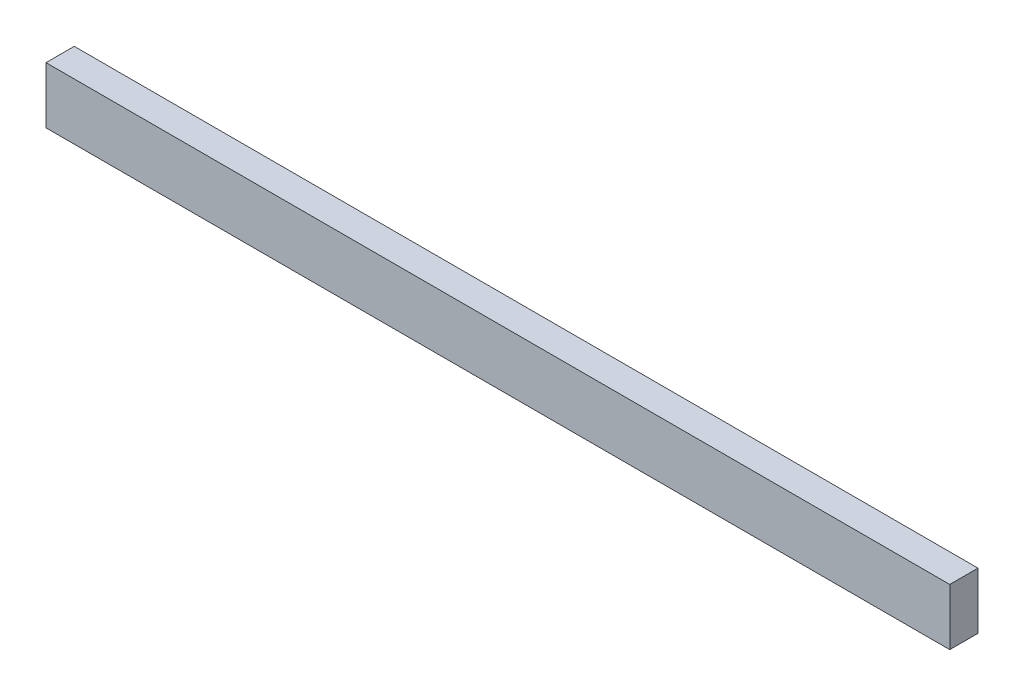
ISO-10303-21;
HEADER;
FILE_DESCRIPTION(('STEP AP214'),'2;1');
FILE_NAME('part.step','',(''),(''),'','','');
FILE_SCHEMA(('AUTOMOTIVE_DESIGN { 1 0 10303 214 1 1 1 1 }'));
ENDSEC;
DATA;
#1=APPLICATION_CONTEXT('core data for automotive mechanical design processes');
#2=APPLICATION_PROTOCOL_DEFINITION('international standard','automotive_design',2000,#1);
#3=PRODUCT_CONTEXT('',#1,'mechanical');
#4=PRODUCT('Part','Part','',(#3));
#5=PRODUCT_RELATED_PRODUCT_CATEGORY('part','',(#4));
#6=PRODUCT_DEFINITION_FORMATION('','',#4);
#7=PRODUCT_DEFINITION_CONTEXT('part definition',#1,'design');
#8=PRODUCT_DEFINITION('design','',#6,#7);
#9=PRODUCT_DEFINITION_SHAPE('','',#8);
#10=(LENGTH_UNIT() NAMED_UNIT(*) SI_UNIT(.MILLI.,.METRE.));
#11=(NAMED_UNIT(*) PLANE_ANGLE_UNIT() SI_UNIT($,.RADIAN.));
#12=(NAMED_UNIT(*) SI_UNIT($,.STERADIAN.) SOLID_ANGLE_UNIT());
#13=UNCERTAINTY_MEASURE_WITH_UNIT(LENGTH_MEASURE(1.E-05),#10,'distance_accuracy_value','');
#14=(GEOMETRIC_REPRESENTATION_CONTEXT(3) GLOBAL_UNCERTAINTY_ASSIGNED_CONTEXT((#13)) GLOBAL_UNIT_ASSIGNED_CONTEXT((#10,
#11,#12)) REPRESENTATION_CONTEXT('',''));
#15=CARTESIAN_POINT('',(0.,0.,0.));
#16=DIRECTION('',(0.,0.,1.));
#17=DIRECTION('',(1.,0.,0.));
#18=AXIS2_PLACEMENT_3D('',#15,#16,#17);
#19=CARTESIAN_POINT('',(58.5124494054143,8.30021736228653,3.175));
#20=DIRECTION('',(-1.,0.,0.));
#21=DIRECTION('',(0.,0.,1.));
#22=AXIS2_PLACEMENT_3D('',#19,#20,#21);
#23=PLANE('',#22);
#24=DIRECTION('',(0.,1.,0.));
#25=VECTOR('',#24,1.);
#26=CARTESIAN_POINT('',(58.5124494054143,8.30021736228653,0.));
#27=LINE('',#26,#25);
#28=CARTESIAN_POINT('',(58.5124494054143,8.30021736228653,0.));
#29=VERTEX_POINT('',#28);
#30=CARTESIAN_POINT('',(58.5124494054143,14.6502173622865,0.));
#31=VERTEX_POINT('',#30);
#32=EDGE_CURVE('E96',#29,#31,#27,.T.);
#33=ORIENTED_EDGE('',*,*,#32,.T.);
#34=DIRECTION('',(0.,0.,-1.));
#35=VECTOR('',#34,1.);
#36=CARTESIAN_POINT('',(58.5124494054143,14.6502173622865,3.175));
#37=LINE('',#36,#35);
#38=CARTESIAN_POINT('',(58.5124494054143,14.6502173622865,3.175));
#39=VERTEX_POINT('',#38);
#40=EDGE_CURVE('E11',#39,#31,#37,.T.);
#41=ORIENTED_EDGE('',*,*,#40,.F.);
#42=DIRECTION('',(0.,1.,0.));
#43=VECTOR('',#42,1.);
#44=CARTESIAN_POINT('',(58.5124494054143,8.30021736228653,3.175));
#45=LINE('',#44,#43);
#46=CARTESIAN_POINT('',(58.5124494054143,8.30021736228653,3.175));
#47=VERTEX_POINT('',#46);
#48=EDGE_CURVE('E84',#47,#39,#45,.T.);
#49=ORIENTED_EDGE('',*,*,#48,.F.);
#50=DIRECTION('',(0.,0.,-1.));
#51=VECTOR('',#50,1.);
#52=CARTESIAN_POINT('',(58.5124494054143,8.30021736228653,3.175));
#53=LINE('',#52,#51);
#54=EDGE_CURVE('E92',#47,#29,#53,.T.);
#55=ORIENTED_EDGE('',*,*,#54,.T.);
#56=EDGE_LOOP('',(#33,#41,#49,#55));
#57=FACE_BOUND('',#56,.T.);
#58=ADVANCED_FACE('F33',(#57),#23,.F.);
#59=CARTESIAN_POINT('',(-43.0875505945857,14.6502173622865,3.175));
#60=DIRECTION('',(0.,-1.,0.));
#61=DIRECTION('',(0.,0.,-1.));
#62=AXIS2_PLACEMENT_3D('',#59,#60,#61);
#63=PLANE('',#62);
#64=DIRECTION('',(-1.,0.,0.));
#65=VECTOR('',#64,1.);
#66=CARTESIAN_POINT('',(-43.0875505945857,14.6502173622865,0.));
#67=LINE('',#66,#65);
#68=CARTESIAN_POINT('',(-43.0875505945857,14.6502173622865,0.));
#69=VERTEX_POINT('',#68);
#70=EDGE_CURVE('E88',#31,#69,#67,.T.);
#71=ORIENTED_EDGE('',*,*,#70,.T.);
#72=DIRECTION('',(0.,0.,-1.));
#73=VECTOR('',#72,1.);
#74=CARTESIAN_POINT('',(-43.0875505945857,14.6502173622865,3.175));
#75=LINE('',#74,#73);
#76=CARTESIAN_POINT('',(-43.0875505945857,14.6502173622865,3.175));
#77=VERTEX_POINT('',#76);
#78=EDGE_CURVE('E41',#77,#69,#75,.T.);
#79=ORIENTED_EDGE('',*,*,#78,.F.);
#80=DIRECTION('',(-1.,0.,0.));
#81=VECTOR('',#80,1.);
#82=CARTESIAN_POINT('',(-43.0875505945857,14.6502173622865,3.175));
#83=LINE('',#82,#81);
#84=EDGE_CURVE('E79',#39,#77,#83,.T.);
#85=ORIENTED_EDGE('',*,*,#84,.F.);
#86=ORIENTED_EDGE('',*,*,#40,.T.);
#87=EDGE_LOOP('',(#71,#79,#85,#86));
#88=FACE_BOUND('',#87,.T.);
#89=ADVANCED_FACE('F87',(#88),#63,.F.);
#90=CARTESIAN_POINT('',(-43.0875505945857,8.30021736228653,3.175));
#91=DIRECTION('',(1.,0.,0.));
#92=DIRECTION('',(0.,0.,-1.));
#93=AXIS2_PLACEMENT_3D('',#90,#91,#92);
#94=PLANE('',#93);
#95=DIRECTION('',(0.,-1.,0.));
#96=VECTOR('',#95,1.);
#97=CARTESIAN_POINT('',(-43.0875505945857,8.30021736228653,0.));
#98=LINE('',#97,#96);
#99=CARTESIAN_POINT('',(-43.0875505945857,8.30021736228653,0.));
#100=VERTEX_POINT('',#99);
#101=EDGE_CURVE('E66',#69,#100,#98,.T.);
#102=ORIENTED_EDGE('',*,*,#101,.T.);
#103=DIRECTION('',(0.,0.,-1.));
#104=VECTOR('',#103,1.);
#105=CARTESIAN_POINT('',(-43.0875505945857,8.30021736228653,3.175));
#106=LINE('',#105,#104);
#107=CARTESIAN_POINT('',(-43.0875505945857,8.30021736228653,3.175));
#108=VERTEX_POINT('',#107);
#109=EDGE_CURVE('E89',#108,#100,#106,.T.);
#110=ORIENTED_EDGE('',*,*,#109,.F.);
#111=DIRECTION('',(0.,-1.,0.));
#112=VECTOR('',#111,1.);
#113=CARTESIAN_POINT('',(-43.0875505945857,8.30021736228653,3.175));
#114=LINE('',#113,#112);
#115=EDGE_CURVE('E82',#77,#108,#114,.T.);
#116=ORIENTED_EDGE('',*,*,#115,.F.);
#117=ORIENTED_EDGE('',*,*,#78,.T.);
#118=EDGE_LOOP('',(#102,#110,#116,#117));
#119=FACE_BOUND('',#118,.T.);
#120=ADVANCED_FACE('F90',(#119),#94,.F.);
#121=CARTESIAN_POINT('',(-43.0875505945857,8.30021736228653,3.175));
#122=DIRECTION('',(0.,1.,0.));
#123=DIRECTION('',(0.,0.,1.));
#124=AXIS2_PLACEMENT_3D('',#121,#122,#123);
#125=PLANE('',#124);
#126=DIRECTION('',(1.,0.,0.));
#127=VECTOR('',#126,1.);
#128=CARTESIAN_POINT('',(-43.0875505945857,8.30021736228653,0.));
#129=LINE('',#128,#127);
#130=EDGE_CURVE('E72',#100,#29,#129,.T.);
#131=ORIENTED_EDGE('',*,*,#130,.T.);
#132=ORIENTED_EDGE('',*,*,#54,.F.);
#133=DIRECTION('',(1.,0.,0.));
#134=VECTOR('',#133,1.);
#135=CARTESIAN_POINT('',(-43.0875505945857,8.30021736228653,3.175));
#136=LINE('',#135,#134);
#137=EDGE_CURVE('E49',#108,#47,#136,.T.);
#138=ORIENTED_EDGE('',*,*,#137,.F.);
#139=ORIENTED_EDGE('',*,*,#109,.T.);
#140=EDGE_LOOP('',(#131,#132,#138,#139));
#141=FACE_BOUND('',#140,.T.);
#142=ADVANCED_FACE('F103',(#141),#125,.F.);
#143=CARTESIAN_POINT('',(0.,0.,3.175));
#144=DIRECTION('',(0.,0.,-1.));
#145=DIRECTION('',(-1.,0.,0.));
#146=AXIS2_PLACEMENT_3D('',#143,#144,#145);
#147=PLANE('',#146);
#148=ORIENTED_EDGE('',*,*,#48,.T.);
#149=ORIENTED_EDGE('',*,*,#84,.T.);
#150=ORIENTED_EDGE('',*,*,#115,.T.);
#151=ORIENTED_EDGE('',*,*,#137,.T.);
#152=EDGE_LOOP('',(#148,#149,#150,#151));
#153=FACE_BOUND('',#152,.T.);
#154=ADVANCED_FACE('F80',(#153),#147,.F.);
#155=CARTESIAN_POINT('',(0.,0.,0.));
#156=DIRECTION('',(0.,0.,-1.));
#157=DIRECTION('',(-1.,0.,0.));
#158=AXIS2_PLACEMENT_3D('',#155,#156,#157);
#159=PLANE('',#158);
#160=ORIENTED_EDGE('',*,*,#32,.F.);
#161=ORIENTED_EDGE('',*,*,#130,.F.);
#162=ORIENTED_EDGE('',*,*,#101,.F.);
#163=ORIENTED_EDGE('',*,*,#70,.F.);
#164=EDGE_LOOP('',(#160,#161,#162,#163));
#165=FACE_BOUND('',#164,.T.);
#166=ADVANCED_FACE('F106',(#165),#159,.T.);
#167=CLOSED_SHELL('',(#58,#89,#120,#142,#154,#166));
#168=MANIFOLD_SOLID_BREP('B2',#167);
#169=ADVANCED_BREP_SHAPE_REPRESENTATION('',(#18,#168),#14);
#170=SHAPE_DEFINITION_REPRESENTATION(#9,#169);
ENDSEC;
END-ISO-10303-21;
